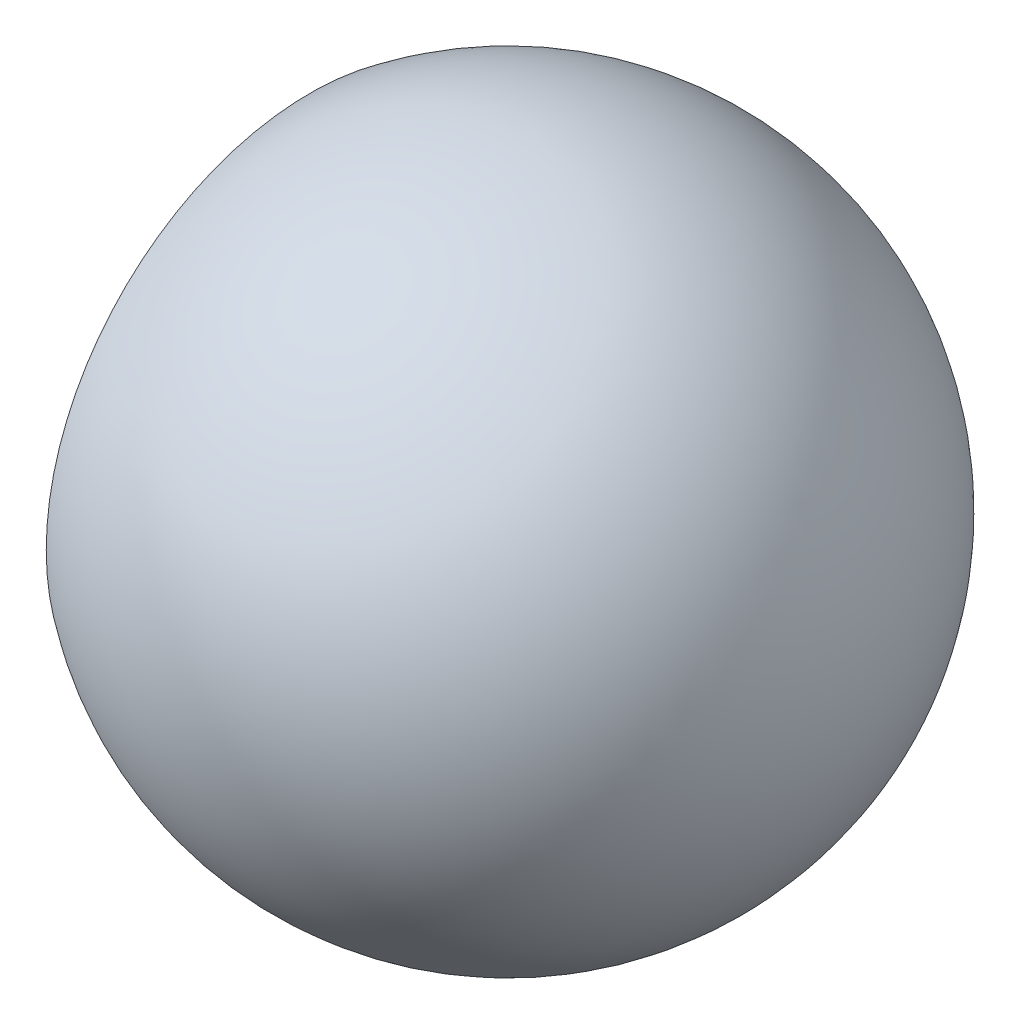
ISO-10303-21;
HEADER;
FILE_DESCRIPTION(('STEP AP214'),'2;1');
FILE_NAME('part.step','',(''),(''),'','','');
FILE_SCHEMA(('AUTOMOTIVE_DESIGN { 1 0 10303 214 1 1 1 1 }'));
ENDSEC;
DATA;
#1=APPLICATION_CONTEXT('core data for automotive mechanical design processes');
#2=APPLICATION_PROTOCOL_DEFINITION('international standard','automotive_design',2000,#1);
#3=PRODUCT_CONTEXT('',#1,'mechanical');
#4=PRODUCT('Part','Part','',(#3));
#5=PRODUCT_RELATED_PRODUCT_CATEGORY('part','',(#4));
#6=PRODUCT_DEFINITION_FORMATION('','',#4);
#7=PRODUCT_DEFINITION_CONTEXT('part definition',#1,'design');
#8=PRODUCT_DEFINITION('design','',#6,#7);
#9=PRODUCT_DEFINITION_SHAPE('','',#8);
#10=(LENGTH_UNIT() NAMED_UNIT(*) SI_UNIT(.MILLI.,.METRE.));
#11=(NAMED_UNIT(*) PLANE_ANGLE_UNIT() SI_UNIT($,.RADIAN.));
#12=(NAMED_UNIT(*) SI_UNIT($,.STERADIAN.) SOLID_ANGLE_UNIT());
#13=UNCERTAINTY_MEASURE_WITH_UNIT(LENGTH_MEASURE(1.E-05),#10,'distance_accuracy_value','');
#14=(GEOMETRIC_REPRESENTATION_CONTEXT(3) GLOBAL_UNCERTAINTY_ASSIGNED_CONTEXT((#13)) GLOBAL_UNIT_ASSIGNED_CONTEXT((#10,
#11,#12)) REPRESENTATION_CONTEXT('',''));
#15=CARTESIAN_POINT('',(0.,0.,0.));
#16=DIRECTION('',(0.,0.,1.));
#17=DIRECTION('',(1.,0.,0.));
#18=AXIS2_PLACEMENT_3D('',#15,#16,#17);
#19=CARTESIAN_POINT('',(0.,0.,0.));
#20=DIRECTION('',(-1.,0.,0.));
#21=DIRECTION('',(0.,0.,1.));
#22=AXIS2_PLACEMENT_3D('',#19,#20,#21);
#23=PLANE('',#22);
#24=CARTESIAN_POINT('',(0.,0.,0.));
#25=DIRECTION('',(-1.,0.,0.));
#26=DIRECTION('',(0.,0.,1.));
#27=AXIS2_PLACEMENT_3D('',#24,#25,#26);
#28=CIRCLE('',#27,4.);
#29=CARTESIAN_POINT('',(0.,0.,4.));
#30=VERTEX_POINT('',#29);
#31=EDGE_CURVE('E10',#30,#30,#28,.T.);
#32=ORIENTED_EDGE('',*,*,#31,.T.);
#33=EDGE_LOOP('',(#32));
#34=FACE_BOUND('',#33,.T.);
#35=ADVANCED_FACE('F40',(#34),#23,.T.);
#36=CARTESIAN_POINT('',(0.,0.,0.));
#37=DIRECTION('',(-1.,0.,0.));
#38=DIRECTION('',(0.,0.,1.));
#39=AXIS2_PLACEMENT_3D('',#36,#37,#38);
#40=CYLINDRICAL_SURFACE('',#39,4.);
#41=CARTESIAN_POINT('',(-6.,0.,0.));
#42=DIRECTION('',(-1.,0.,0.));
#43=DIRECTION('',(0.,0.,1.));
#44=AXIS2_PLACEMENT_3D('',#41,#42,#43);
#45=CIRCLE('',#44,4.);
#46=CARTESIAN_POINT('',(-6.,0.,4.));
#47=VERTEX_POINT('',#46);
#48=EDGE_CURVE('E47',#47,#47,#45,.T.);
#49=ORIENTED_EDGE('',*,*,#48,.T.);
#50=EDGE_LOOP('',(#49));
#51=FACE_BOUND('',#50,.T.);
#52=ORIENTED_EDGE('',*,*,#31,.F.);
#53=EDGE_LOOP('',(#52));
#54=FACE_BOUND('',#53,.T.);
#55=ADVANCED_FACE('F69',(#51,#54),#40,.F.);
#56=CARTESIAN_POINT('',(-6.,-4.,0.));
#57=DIRECTION('',(-1.,0.,0.));
#58=DIRECTION('',(0.,0.,1.));
#59=AXIS2_PLACEMENT_3D('',#56,#57,#58);
#60=PLANE('',#59);
#61=CARTESIAN_POINT('',(-6.,0.,0.));
#62=DIRECTION('',(-1.,0.,0.));
#63=DIRECTION('',(0.,0.,1.));
#64=AXIS2_PLACEMENT_3D('',#61,#62,#63);
#65=CIRCLE('',#64,8.);
#66=CARTESIAN_POINT('',(-6.,0.,8.));
#67=VERTEX_POINT('',#66);
#68=EDGE_CURVE('E52',#67,#67,#65,.T.);
#69=ORIENTED_EDGE('',*,*,#68,.T.);
#70=EDGE_LOOP('',(#69));
#71=FACE_BOUND('',#70,.T.);
#72=ORIENTED_EDGE('',*,*,#48,.F.);
#73=EDGE_LOOP('',(#72));
#74=FACE_BOUND('',#73,.T.);
#75=ADVANCED_FACE('F60',(#71,#74),#60,.T.);
#76=CARTESIAN_POINT('',(0.,0.,0.));
#77=DIRECTION('',(-1.,0.,0.));
#78=DIRECTION('',(0.,-1.,0.));
#79=AXIS2_PLACEMENT_3D('',#76,#77,#78);
#80=SPHERICAL_SURFACE('',#79,10.);
#81=ORIENTED_EDGE('',*,*,#68,.F.);
#82=EDGE_LOOP('',(#81));
#83=FACE_BOUND('',#82,.T.);
#84=ADVANCED_FACE('F63',(#83),#80,.T.);
#85=CLOSED_SHELL('',(#35,#55,#75,#84));
#86=MANIFOLD_SOLID_BREP('B2',#85);
#87=ADVANCED_BREP_SHAPE_REPRESENTATION('',(#18,#86),#14);
#88=SHAPE_DEFINITION_REPRESENTATION(#9,#87);
ENDSEC;
END-ISO-10303-21;
